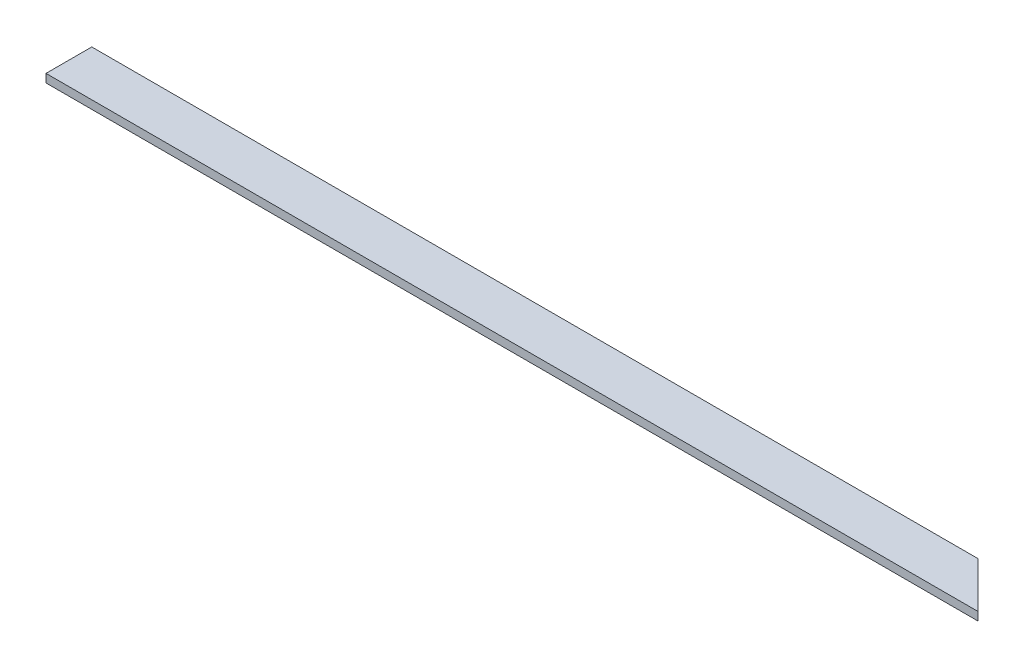
ISO-10303-21;
HEADER;
FILE_DESCRIPTION(('STEP AP214'),'2;1');
FILE_NAME('part.step','',(''),(''),'','','');
FILE_SCHEMA(('AUTOMOTIVE_DESIGN { 1 0 10303 214 1 1 1 1 }'));
ENDSEC;
DATA;
#1=APPLICATION_CONTEXT('core data for automotive mechanical design processes');
#2=APPLICATION_PROTOCOL_DEFINITION('international standard','automotive_design',2000,#1);
#3=PRODUCT_CONTEXT('',#1,'mechanical');
#4=PRODUCT('Part','Part','',(#3));
#5=PRODUCT_RELATED_PRODUCT_CATEGORY('part','',(#4));
#6=PRODUCT_DEFINITION_FORMATION('','',#4);
#7=PRODUCT_DEFINITION_CONTEXT('part definition',#1,'design');
#8=PRODUCT_DEFINITION('design','',#6,#7);
#9=PRODUCT_DEFINITION_SHAPE('','',#8);
#10=(LENGTH_UNIT() NAMED_UNIT(*) SI_UNIT(.MILLI.,.METRE.));
#11=(NAMED_UNIT(*) PLANE_ANGLE_UNIT() SI_UNIT($,.RADIAN.));
#12=(NAMED_UNIT(*) SI_UNIT($,.STERADIAN.) SOLID_ANGLE_UNIT());
#13=UNCERTAINTY_MEASURE_WITH_UNIT(LENGTH_MEASURE(1.E-05),#10,'distance_accuracy_value','');
#14=(GEOMETRIC_REPRESENTATION_CONTEXT(3) GLOBAL_UNCERTAINTY_ASSIGNED_CONTEXT((#13)) GLOBAL_UNIT_ASSIGNED_CONTEXT((#10,
#11,#12)) REPRESENTATION_CONTEXT('',''));
#15=CARTESIAN_POINT('',(0.,0.,0.));
#16=DIRECTION('',(0.,0.,1.));
#17=DIRECTION('',(1.,0.,0.));
#18=AXIS2_PLACEMENT_3D('',#15,#16,#17);
#19=CARTESIAN_POINT('',(0.,25.4,-139.7));
#20=DIRECTION('',(0.,0.,-1.));
#21=DIRECTION('',(-1.,0.,0.));
#22=AXIS2_PLACEMENT_3D('',#19,#20,#21);
#23=PLANE('',#22);
#24=DIRECTION('',(1.,0.,0.));
#25=VECTOR('',#24,1.);
#26=CARTESIAN_POINT('',(0.,0.,-139.7));
#27=LINE('',#26,#25);
#28=CARTESIAN_POINT('',(-5.27333732236457E-13,0.,-139.7));
#29=VERTEX_POINT('',#28);
#30=CARTESIAN_POINT('',(2705.1,0.,-139.7));
#31=VERTEX_POINT('',#30);
#32=EDGE_CURVE('E98',#29,#31,#27,.T.);
#33=ORIENTED_EDGE('',*,*,#32,.F.);
#34=DIRECTION('',(0.,-1.,0.));
#35=VECTOR('',#34,1.);
#36=CARTESIAN_POINT('',(-5.27333732236457E-13,25.4,-139.7));
#37=LINE('',#36,#35);
#38=CARTESIAN_POINT('',(-5.27333732236457E-13,25.4,-139.7));
#39=VERTEX_POINT('',#38);
#40=EDGE_CURVE('E11',#39,#29,#37,.T.);
#41=ORIENTED_EDGE('',*,*,#40,.F.);
#42=DIRECTION('',(1.,0.,0.));
#43=VECTOR('',#42,1.);
#44=CARTESIAN_POINT('',(0.,25.4,-139.7));
#45=LINE('',#44,#43);
#46=CARTESIAN_POINT('',(2705.1,25.4,-139.7));
#47=VERTEX_POINT('',#46);
#48=EDGE_CURVE('E92',#39,#47,#45,.T.);
#49=ORIENTED_EDGE('',*,*,#48,.T.);
#50=DIRECTION('',(0.,-1.,0.));
#51=VECTOR('',#50,1.);
#52=CARTESIAN_POINT('',(2705.1,25.4,-139.7));
#53=LINE('',#52,#51);
#54=EDGE_CURVE('E73',#47,#31,#53,.T.);
#55=ORIENTED_EDGE('',*,*,#54,.T.);
#56=EDGE_LOOP('',(#33,#41,#49,#55));
#57=FACE_BOUND('',#56,.T.);
#58=ADVANCED_FACE('F35',(#57),#23,.T.);
#59=CARTESIAN_POINT('',(0.,25.4,0.));
#60=DIRECTION('',(-1.,0.,0.));
#61=DIRECTION('',(0.,0.,1.));
#62=AXIS2_PLACEMENT_3D('',#59,#60,#61);
#63=PLANE('',#62);
#64=DIRECTION('',(0.,0.,-1.));
#65=VECTOR('',#64,1.);
#66=CARTESIAN_POINT('',(0.,0.,0.));
#67=LINE('',#66,#65);
#68=CARTESIAN_POINT('',(0.,0.,0.));
#69=VERTEX_POINT('',#68);
#70=EDGE_CURVE('E86',#69,#29,#67,.T.);
#71=ORIENTED_EDGE('',*,*,#70,.F.);
#72=DIRECTION('',(0.,-1.,0.));
#73=VECTOR('',#72,1.);
#74=CARTESIAN_POINT('',(0.,25.4,0.));
#75=LINE('',#74,#73);
#76=CARTESIAN_POINT('',(0.,25.4,0.));
#77=VERTEX_POINT('',#76);
#78=EDGE_CURVE('E43',#77,#69,#75,.T.);
#79=ORIENTED_EDGE('',*,*,#78,.F.);
#80=DIRECTION('',(0.,0.,-1.));
#81=VECTOR('',#80,1.);
#82=CARTESIAN_POINT('',(0.,25.4,0.));
#83=LINE('',#82,#81);
#84=EDGE_CURVE('E84',#77,#39,#83,.T.);
#85=ORIENTED_EDGE('',*,*,#84,.T.);
#86=ORIENTED_EDGE('',*,*,#40,.T.);
#87=EDGE_LOOP('',(#71,#79,#85,#86));
#88=FACE_BOUND('',#87,.T.);
#89=ADVANCED_FACE('F82',(#88),#63,.T.);
#90=CARTESIAN_POINT('',(0.,25.4,0.));
#91=DIRECTION('',(0.,0.,-1.));
#92=DIRECTION('',(-1.,0.,0.));
#93=AXIS2_PLACEMENT_3D('',#90,#91,#92);
#94=PLANE('',#93);
#95=DIRECTION('',(1.,0.,0.));
#96=VECTOR('',#95,1.);
#97=CARTESIAN_POINT('',(0.,0.,0.));
#98=LINE('',#97,#96);
#99=CARTESIAN_POINT('',(2844.8,0.,0.));
#100=VERTEX_POINT('',#99);
#101=EDGE_CURVE('E66',#69,#100,#98,.T.);
#102=ORIENTED_EDGE('',*,*,#101,.T.);
#103=DIRECTION('',(0.,-1.,0.));
#104=VECTOR('',#103,1.);
#105=CARTESIAN_POINT('',(2844.8,25.4,0.));
#106=LINE('',#105,#104);
#107=CARTESIAN_POINT('',(2844.8,25.4,0.));
#108=VERTEX_POINT('',#107);
#109=EDGE_CURVE('E87',#108,#100,#106,.T.);
#110=ORIENTED_EDGE('',*,*,#109,.F.);
#111=DIRECTION('',(1.,0.,0.));
#112=VECTOR('',#111,1.);
#113=CARTESIAN_POINT('',(0.,25.4,0.));
#114=LINE('',#113,#112);
#115=EDGE_CURVE('E88',#77,#108,#114,.T.);
#116=ORIENTED_EDGE('',*,*,#115,.F.);
#117=ORIENTED_EDGE('',*,*,#78,.T.);
#118=EDGE_LOOP('',(#102,#110,#116,#117));
#119=FACE_BOUND('',#118,.T.);
#120=ADVANCED_FACE('F89',(#119),#94,.F.);
#121=CARTESIAN_POINT('',(1422.4,25.4,-1422.4));
#122=DIRECTION('',(-0.707106781186547,0.,0.707106781186548));
#123=DIRECTION('',(0.707106781186548,0.,0.707106781186547));
#124=AXIS2_PLACEMENT_3D('',#121,#122,#123);
#125=PLANE('',#124);
#126=DIRECTION('',(-0.707106781186549,0.,-0.707106781186547));
#127=VECTOR('',#126,1.);
#128=CARTESIAN_POINT('',(1422.4,0.,-1422.4));
#129=LINE('',#128,#127);
#130=EDGE_CURVE('E94',#100,#31,#129,.T.);
#131=ORIENTED_EDGE('',*,*,#130,.T.);
#132=ORIENTED_EDGE('',*,*,#54,.F.);
#133=DIRECTION('',(-0.707106781186549,0.,-0.707106781186547));
#134=VECTOR('',#133,1.);
#135=CARTESIAN_POINT('',(1422.4,25.4,-1422.4));
#136=LINE('',#135,#134);
#137=EDGE_CURVE('E51',#108,#47,#136,.T.);
#138=ORIENTED_EDGE('',*,*,#137,.F.);
#139=ORIENTED_EDGE('',*,*,#109,.T.);
#140=EDGE_LOOP('',(#131,#132,#138,#139));
#141=FACE_BOUND('',#140,.T.);
#142=ADVANCED_FACE('F107',(#141),#125,.F.);
#143=CARTESIAN_POINT('',(0.,25.4,0.));
#144=DIRECTION('',(0.,1.,0.));
#145=DIRECTION('',(0.,0.,1.));
#146=AXIS2_PLACEMENT_3D('',#143,#144,#145);
#147=PLANE('',#146);
#148=ORIENTED_EDGE('',*,*,#48,.F.);
#149=ORIENTED_EDGE('',*,*,#84,.F.);
#150=ORIENTED_EDGE('',*,*,#115,.T.);
#151=ORIENTED_EDGE('',*,*,#137,.T.);
#152=EDGE_LOOP('',(#148,#149,#150,#151));
#153=FACE_BOUND('',#152,.T.);
#154=ADVANCED_FACE('F91',(#153),#147,.T.);
#155=CARTESIAN_POINT('',(0.,0.,0.));
#156=DIRECTION('',(0.,1.,0.));
#157=DIRECTION('',(0.,0.,1.));
#158=AXIS2_PLACEMENT_3D('',#155,#156,#157);
#159=PLANE('',#158);
#160=ORIENTED_EDGE('',*,*,#32,.T.);
#161=ORIENTED_EDGE('',*,*,#130,.F.);
#162=ORIENTED_EDGE('',*,*,#101,.F.);
#163=ORIENTED_EDGE('',*,*,#70,.T.);
#164=EDGE_LOOP('',(#160,#161,#162,#163));
#165=FACE_BOUND('',#164,.T.);
#166=ADVANCED_FACE('F109',(#165),#159,.F.);
#167=CLOSED_SHELL('',(#58,#89,#120,#142,#154,#166));
#168=MANIFOLD_SOLID_BREP('B2',#167);
#169=ADVANCED_BREP_SHAPE_REPRESENTATION('',(#18,#168),#14);
#170=SHAPE_DEFINITION_REPRESENTATION(#9,#169);
ENDSEC;
END-ISO-10303-21;
